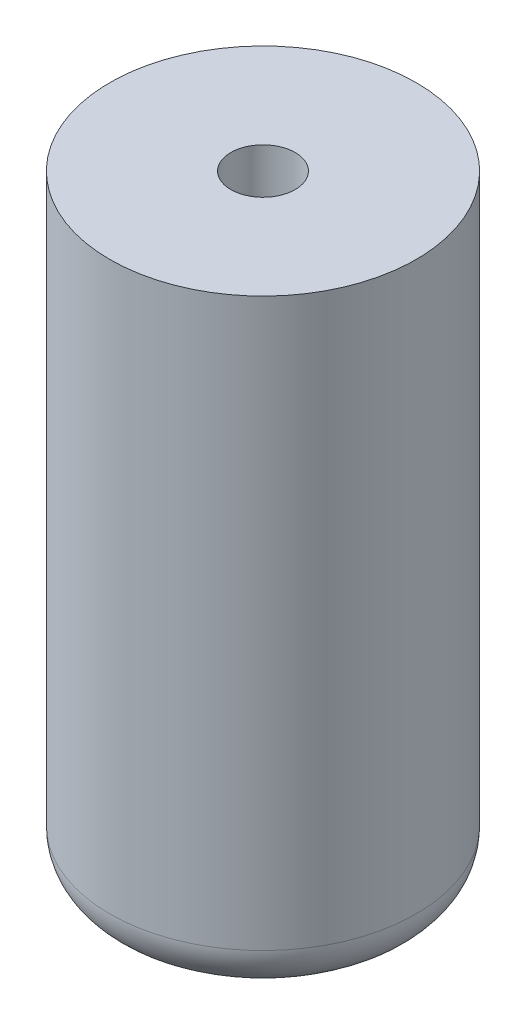
ISO-10303-21;
HEADER;
FILE_DESCRIPTION(('STEP AP214'),'2;1');
FILE_NAME('part.step','',(''),(''),'','','');
FILE_SCHEMA(('AUTOMOTIVE_DESIGN { 1 0 10303 214 1 1 1 1 }'));
ENDSEC;
DATA;
#1=APPLICATION_CONTEXT('core data for automotive mechanical design processes');
#2=APPLICATION_PROTOCOL_DEFINITION('international standard','automotive_design',2000,#1);
#3=PRODUCT_CONTEXT('',#1,'mechanical');
#4=PRODUCT('Part','Part','',(#3));
#5=PRODUCT_RELATED_PRODUCT_CATEGORY('part','',(#4));
#6=PRODUCT_DEFINITION_FORMATION('','',#4);
#7=PRODUCT_DEFINITION_CONTEXT('part definition',#1,'design');
#8=PRODUCT_DEFINITION('design','',#6,#7);
#9=PRODUCT_DEFINITION_SHAPE('','',#8);
#10=(LENGTH_UNIT() NAMED_UNIT(*) SI_UNIT(.MILLI.,.METRE.));
#11=(NAMED_UNIT(*) PLANE_ANGLE_UNIT() SI_UNIT($,.RADIAN.));
#12=(NAMED_UNIT(*) SI_UNIT($,.STERADIAN.) SOLID_ANGLE_UNIT());
#13=UNCERTAINTY_MEASURE_WITH_UNIT(LENGTH_MEASURE(1.E-05),#10,'distance_accuracy_value','');
#14=(GEOMETRIC_REPRESENTATION_CONTEXT(3) GLOBAL_UNCERTAINTY_ASSIGNED_CONTEXT((#13)) GLOBAL_UNIT_ASSIGNED_CONTEXT((#10,
#11,#12)) REPRESENTATION_CONTEXT('',''));
#15=CARTESIAN_POINT('',(0.,0.,0.));
#16=DIRECTION('',(0.,0.,1.));
#17=DIRECTION('',(1.,0.,0.));
#18=AXIS2_PLACEMENT_3D('',#15,#16,#17);
#19=CARTESIAN_POINT('',(0.,40.,0.));
#20=DIRECTION('',(0.,-1.,0.));
#21=DIRECTION('',(0.,0.,-1.));
#22=AXIS2_PLACEMENT_3D('',#19,#20,#21);
#23=CYLINDRICAL_SURFACE('',#22,10.);
#24=CARTESIAN_POINT('',(0.,3.,0.));
#25=DIRECTION('',(0.,1.,0.));
#26=DIRECTION('',(0.,0.,1.));
#27=AXIS2_PLACEMENT_3D('',#24,#25,#26);
#28=CIRCLE('',#27,10.);
#29=CARTESIAN_POINT('',(0.,3.,10.));
#30=VERTEX_POINT('',#29);
#31=EDGE_CURVE('E38',#30,#30,#28,.T.);
#32=ORIENTED_EDGE('',*,*,#31,.T.);
#33=EDGE_LOOP('',(#32));
#34=FACE_BOUND('',#33,.T.);
#35=CARTESIAN_POINT('',(0.,40.,0.));
#36=DIRECTION('',(0.,1.,0.));
#37=DIRECTION('',(0.,0.,1.));
#38=AXIS2_PLACEMENT_3D('',#35,#36,#37);
#39=CIRCLE('',#38,10.);
#40=CARTESIAN_POINT('',(0.,40.,10.));
#41=VERTEX_POINT('',#40);
#42=EDGE_CURVE('E42',#41,#41,#39,.T.);
#43=ORIENTED_EDGE('',*,*,#42,.F.);
#44=EDGE_LOOP('',(#43));
#45=FACE_BOUND('',#44,.T.);
#46=ADVANCED_FACE('F31',(#34,#45),#23,.T.);
#47=CARTESIAN_POINT('',(0.,40.,0.));
#48=DIRECTION('',(0.,1.,0.));
#49=DIRECTION('',(0.,0.,1.));
#50=AXIS2_PLACEMENT_3D('',#47,#48,#49);
#51=PLANE('',#50);
#52=CARTESIAN_POINT('',(0.,40.,0.));
#53=DIRECTION('',(0.,1.,0.));
#54=DIRECTION('',(0.,0.,1.));
#55=AXIS2_PLACEMENT_3D('',#52,#53,#54);
#56=CIRCLE('',#55,2.1);
#57=CARTESIAN_POINT('',(0.,40.,2.1));
#58=VERTEX_POINT('',#57);
#59=EDGE_CURVE('E49',#58,#58,#56,.T.);
#60=ORIENTED_EDGE('',*,*,#59,.F.);
#61=EDGE_LOOP('',(#60));
#62=FACE_BOUND('',#61,.T.);
#63=ORIENTED_EDGE('',*,*,#42,.T.);
#64=EDGE_LOOP('',(#63));
#65=FACE_BOUND('',#64,.T.);
#66=ADVANCED_FACE('F63',(#62,#65),#51,.T.);
#67=CARTESIAN_POINT('',(0.,0.,0.));
#68=DIRECTION('',(0.,1.,0.));
#69=DIRECTION('',(0.,0.,1.));
#70=AXIS2_PLACEMENT_3D('',#67,#68,#69);
#71=PLANE('',#70);
#72=CARTESIAN_POINT('',(0.,0.,0.));
#73=DIRECTION('',(0.,1.,0.));
#74=DIRECTION('',(0.,0.,1.));
#75=AXIS2_PLACEMENT_3D('',#72,#73,#74);
#76=CIRCLE('',#75,7.);
#77=CARTESIAN_POINT('',(0.,0.,7.));
#78=VERTEX_POINT('',#77);
#79=EDGE_CURVE('E10',#78,#78,#76,.F.);
#80=ORIENTED_EDGE('',*,*,#79,.T.);
#81=EDGE_LOOP('',(#80));
#82=FACE_BOUND('',#81,.T.);
#83=ADVANCED_FACE('F66',(#82),#71,.F.);
#84=CARTESIAN_POINT('',(0.,3.,0.));
#85=DIRECTION('',(0.,1.,0.));
#86=DIRECTION('',(0.,0.,1.));
#87=AXIS2_PLACEMENT_3D('',#84,#85,#86);
#88=TOROIDAL_SURFACE('',#87,7.,3.);
#89=ORIENTED_EDGE('',*,*,#79,.F.);
#90=EDGE_LOOP('',(#89));
#91=FACE_BOUND('',#90,.T.);
#92=ORIENTED_EDGE('',*,*,#31,.F.);
#93=EDGE_LOOP('',(#92));
#94=FACE_BOUND('',#93,.T.);
#95=ADVANCED_FACE('F33',(#91,#94),#88,.T.);
#96=CARTESIAN_POINT('',(0.,30.,0.));
#97=DIRECTION('',(0.,1.,0.));
#98=DIRECTION('',(0.,0.,1.));
#99=AXIS2_PLACEMENT_3D('',#96,#97,#98);
#100=CYLINDRICAL_SURFACE('',#99,2.1);
#101=CARTESIAN_POINT('',(0.,30.,0.));
#102=DIRECTION('',(0.,1.,0.));
#103=DIRECTION('',(0.,0.,1.));
#104=AXIS2_PLACEMENT_3D('',#101,#102,#103);
#105=CIRCLE('',#104,2.1);
#106=CARTESIAN_POINT('',(0.,30.,2.1));
#107=VERTEX_POINT('',#106);
#108=EDGE_CURVE('E46',#107,#107,#105,.T.);
#109=ORIENTED_EDGE('',*,*,#108,.F.);
#110=EDGE_LOOP('',(#109));
#111=FACE_BOUND('',#110,.T.);
#112=ORIENTED_EDGE('',*,*,#59,.T.);
#113=EDGE_LOOP('',(#112));
#114=FACE_BOUND('',#113,.T.);
#115=ADVANCED_FACE('F57',(#111,#114),#100,.F.);
#116=CARTESIAN_POINT('',(0.,30.,0.));
#117=DIRECTION('',(0.,1.,0.));
#118=DIRECTION('',(0.,0.,1.));
#119=AXIS2_PLACEMENT_3D('',#116,#117,#118);
#120=PLANE('',#119);
#121=ORIENTED_EDGE('',*,*,#108,.T.);
#122=EDGE_LOOP('',(#121));
#123=FACE_BOUND('',#122,.T.);
#124=ADVANCED_FACE('F55',(#123),#120,.T.);
#125=CLOSED_SHELL('',(#46,#66,#83,#95,#115,#124));
#126=MANIFOLD_SOLID_BREP('B2',#125);
#127=ADVANCED_BREP_SHAPE_REPRESENTATION('',(#18,#126),#14);
#128=SHAPE_DEFINITION_REPRESENTATION(#9,#127);
ENDSEC;
END-ISO-10303-21;
